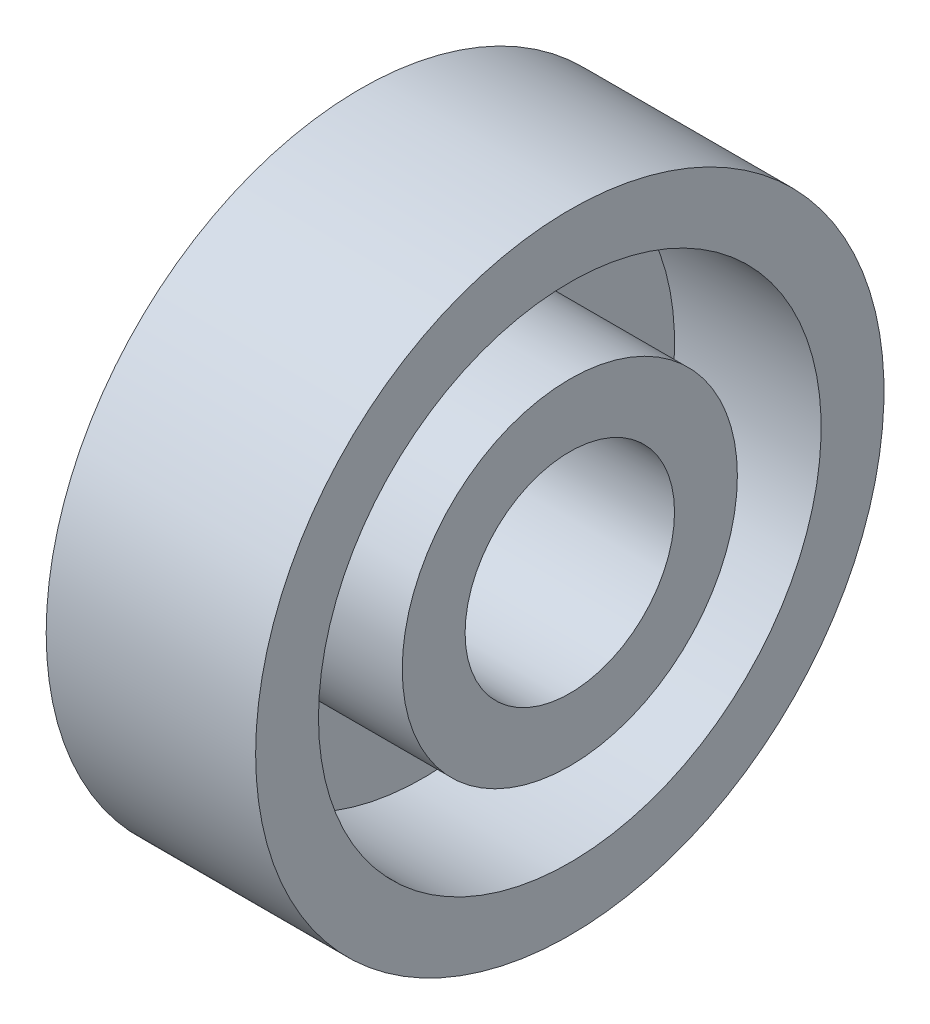
ISO-10303-21;
HEADER;
FILE_DESCRIPTION(('STEP AP214'),'2;1');
FILE_NAME('part.step','',(''),(''),'','','');
FILE_SCHEMA(('AUTOMOTIVE_DESIGN { 1 0 10303 214 1 1 1 1 }'));
ENDSEC;
DATA;
#1=APPLICATION_CONTEXT('core data for automotive mechanical design processes');
#2=APPLICATION_PROTOCOL_DEFINITION('international standard','automotive_design',2000,#1);
#3=PRODUCT_CONTEXT('',#1,'mechanical');
#4=PRODUCT('Part','Part','',(#3));
#5=PRODUCT_RELATED_PRODUCT_CATEGORY('part','',(#4));
#6=PRODUCT_DEFINITION_FORMATION('','',#4);
#7=PRODUCT_DEFINITION_CONTEXT('part definition',#1,'design');
#8=PRODUCT_DEFINITION('design','',#6,#7);
#9=PRODUCT_DEFINITION_SHAPE('','',#8);
#10=(LENGTH_UNIT() NAMED_UNIT(*) SI_UNIT(.MILLI.,.METRE.));
#11=(NAMED_UNIT(*) PLANE_ANGLE_UNIT() SI_UNIT($,.RADIAN.));
#12=(NAMED_UNIT(*) SI_UNIT($,.STERADIAN.) SOLID_ANGLE_UNIT());
#13=UNCERTAINTY_MEASURE_WITH_UNIT(LENGTH_MEASURE(1.E-05),#10,'distance_accuracy_value','');
#14=(GEOMETRIC_REPRESENTATION_CONTEXT(3) GLOBAL_UNCERTAINTY_ASSIGNED_CONTEXT((#13)) GLOBAL_UNIT_ASSIGNED_CONTEXT((#10,
#11,#12)) REPRESENTATION_CONTEXT('',''));
#15=CARTESIAN_POINT('',(0.,0.,0.));
#16=DIRECTION('',(0.,0.,1.));
#17=DIRECTION('',(1.,0.,0.));
#18=AXIS2_PLACEMENT_3D('',#15,#16,#17);
#19=CARTESIAN_POINT('',(4.,3.2,0.));
#20=DIRECTION('',(-1.,0.,0.));
#21=DIRECTION('',(0.,0.,1.));
#22=AXIS2_PLACEMENT_3D('',#19,#20,#21);
#23=PLANE('',#22);
#24=CARTESIAN_POINT('',(4.,0.,0.));
#25=DIRECTION('',(-1.,0.,0.));
#26=DIRECTION('',(0.,0.,1.));
#27=AXIS2_PLACEMENT_3D('',#24,#25,#26);
#28=CIRCLE('',#27,3.2);
#29=CARTESIAN_POINT('',(4.,0.,3.2));
#30=VERTEX_POINT('',#29);
#31=EDGE_CURVE('E56',#30,#30,#28,.T.);
#32=ORIENTED_EDGE('',*,*,#31,.F.);
#33=EDGE_LOOP('',(#32));
#34=FACE_BOUND('',#33,.T.);
#35=CARTESIAN_POINT('',(4.,0.,0.));
#36=DIRECTION('',(-1.,0.,0.));
#37=DIRECTION('',(0.,0.,1.));
#38=AXIS2_PLACEMENT_3D('',#35,#36,#37);
#39=CIRCLE('',#38,2.);
#40=CARTESIAN_POINT('',(4.,0.,2.));
#41=VERTEX_POINT('',#40);
#42=EDGE_CURVE('E10',#41,#41,#39,.T.);
#43=ORIENTED_EDGE('',*,*,#42,.T.);
#44=EDGE_LOOP('',(#43));
#45=FACE_BOUND('',#44,.T.);
#46=ADVANCED_FACE('F28',(#34,#45),#23,.F.);
#47=CARTESIAN_POINT('',(0.,0.,0.));
#48=DIRECTION('',(-1.,0.,0.));
#49=DIRECTION('',(0.,0.,1.));
#50=AXIS2_PLACEMENT_3D('',#47,#48,#49);
#51=CYLINDRICAL_SURFACE('',#50,2.);
#52=ORIENTED_EDGE('',*,*,#42,.F.);
#53=EDGE_LOOP('',(#52));
#54=FACE_BOUND('',#53,.T.);
#55=CARTESIAN_POINT('',(0.,0.,0.));
#56=DIRECTION('',(-1.,0.,0.));
#57=DIRECTION('',(0.,0.,1.));
#58=AXIS2_PLACEMENT_3D('',#55,#56,#57);
#59=CIRCLE('',#58,2.);
#60=CARTESIAN_POINT('',(0.,0.,2.));
#61=VERTEX_POINT('',#60);
#62=EDGE_CURVE('E34',#61,#61,#59,.T.);
#63=ORIENTED_EDGE('',*,*,#62,.T.);
#64=EDGE_LOOP('',(#63));
#65=FACE_BOUND('',#64,.T.);
#66=ADVANCED_FACE('F63',(#54,#65),#51,.F.);
#67=CARTESIAN_POINT('',(0.,2.,0.));
#68=DIRECTION('',(1.,0.,0.));
#69=DIRECTION('',(0.,0.,-1.));
#70=AXIS2_PLACEMENT_3D('',#67,#68,#69);
#71=PLANE('',#70);
#72=ORIENTED_EDGE('',*,*,#62,.F.);
#73=EDGE_LOOP('',(#72));
#74=FACE_BOUND('',#73,.T.);
#75=CARTESIAN_POINT('',(0.,0.,0.));
#76=DIRECTION('',(-1.,0.,0.));
#77=DIRECTION('',(0.,0.,1.));
#78=AXIS2_PLACEMENT_3D('',#75,#76,#77);
#79=CIRCLE('',#78,6.);
#80=CARTESIAN_POINT('',(0.,0.,6.));
#81=VERTEX_POINT('',#80);
#82=EDGE_CURVE('E38',#81,#81,#79,.T.);
#83=ORIENTED_EDGE('',*,*,#82,.T.);
#84=EDGE_LOOP('',(#83));
#85=FACE_BOUND('',#84,.T.);
#86=ADVANCED_FACE('F67',(#74,#85),#71,.F.);
#87=CARTESIAN_POINT('',(0.,0.,0.));
#88=DIRECTION('',(-1.,0.,0.));
#89=DIRECTION('',(0.,0.,1.));
#90=AXIS2_PLACEMENT_3D('',#87,#88,#89);
#91=CYLINDRICAL_SURFACE('',#90,6.);
#92=ORIENTED_EDGE('',*,*,#82,.F.);
#93=EDGE_LOOP('',(#92));
#94=FACE_BOUND('',#93,.T.);
#95=CARTESIAN_POINT('',(4.,0.,0.));
#96=DIRECTION('',(-1.,0.,0.));
#97=DIRECTION('',(0.,0.,1.));
#98=AXIS2_PLACEMENT_3D('',#95,#96,#97);
#99=CIRCLE('',#98,6.);
#100=CARTESIAN_POINT('',(4.,0.,6.));
#101=VERTEX_POINT('',#100);
#102=EDGE_CURVE('E42',#101,#101,#99,.T.);
#103=ORIENTED_EDGE('',*,*,#102,.T.);
#104=EDGE_LOOP('',(#103));
#105=FACE_BOUND('',#104,.T.);
#106=ADVANCED_FACE('F72',(#94,#105),#91,.T.);
#107=CARTESIAN_POINT('',(4.,6.,0.));
#108=DIRECTION('',(-1.,0.,0.));
#109=DIRECTION('',(0.,0.,1.));
#110=AXIS2_PLACEMENT_3D('',#107,#108,#109);
#111=PLANE('',#110);
#112=ORIENTED_EDGE('',*,*,#102,.F.);
#113=EDGE_LOOP('',(#112));
#114=FACE_BOUND('',#113,.T.);
#115=CARTESIAN_POINT('',(4.,0.,0.));
#116=DIRECTION('',(-1.,0.,0.));
#117=DIRECTION('',(0.,0.,1.));
#118=AXIS2_PLACEMENT_3D('',#115,#116,#117);
#119=CIRCLE('',#118,4.8);
#120=CARTESIAN_POINT('',(4.,0.,4.8));
#121=VERTEX_POINT('',#120);
#122=EDGE_CURVE('E47',#121,#121,#119,.T.);
#123=ORIENTED_EDGE('',*,*,#122,.T.);
#124=EDGE_LOOP('',(#123));
#125=FACE_BOUND('',#124,.T.);
#126=ADVANCED_FACE('F78',(#114,#125),#111,.F.);
#127=CARTESIAN_POINT('',(0.,0.,0.));
#128=DIRECTION('',(-1.,0.,0.));
#129=DIRECTION('',(0.,0.,1.));
#130=AXIS2_PLACEMENT_3D('',#127,#128,#129);
#131=CYLINDRICAL_SURFACE('',#130,4.8);
#132=ORIENTED_EDGE('',*,*,#122,.F.);
#133=EDGE_LOOP('',(#132));
#134=FACE_BOUND('',#133,.T.);
#135=CARTESIAN_POINT('',(1.2,0.,0.));
#136=DIRECTION('',(-1.,0.,0.));
#137=DIRECTION('',(0.,0.,1.));
#138=AXIS2_PLACEMENT_3D('',#135,#136,#137);
#139=CIRCLE('',#138,4.8);
#140=CARTESIAN_POINT('',(1.2,0.,4.8));
#141=VERTEX_POINT('',#140);
#142=EDGE_CURVE('E50',#141,#141,#139,.T.);
#143=ORIENTED_EDGE('',*,*,#142,.T.);
#144=EDGE_LOOP('',(#143));
#145=FACE_BOUND('',#144,.T.);
#146=ADVANCED_FACE('F82',(#134,#145),#131,.F.);
#147=CARTESIAN_POINT('',(1.2,4.8,0.));
#148=DIRECTION('',(-1.,0.,0.));
#149=DIRECTION('',(0.,0.,1.));
#150=AXIS2_PLACEMENT_3D('',#147,#148,#149);
#151=PLANE('',#150);
#152=ORIENTED_EDGE('',*,*,#142,.F.);
#153=EDGE_LOOP('',(#152));
#154=FACE_BOUND('',#153,.T.);
#155=CARTESIAN_POINT('',(1.2,0.,0.));
#156=DIRECTION('',(-1.,0.,0.));
#157=DIRECTION('',(0.,0.,1.));
#158=AXIS2_PLACEMENT_3D('',#155,#156,#157);
#159=CIRCLE('',#158,3.2);
#160=CARTESIAN_POINT('',(1.2,0.,3.2));
#161=VERTEX_POINT('',#160);
#162=EDGE_CURVE('E53',#161,#161,#159,.T.);
#163=ORIENTED_EDGE('',*,*,#162,.T.);
#164=EDGE_LOOP('',(#163));
#165=FACE_BOUND('',#164,.T.);
#166=ADVANCED_FACE('F86',(#154,#165),#151,.F.);
#167=CARTESIAN_POINT('',(0.,0.,0.));
#168=DIRECTION('',(-1.,0.,0.));
#169=DIRECTION('',(0.,0.,1.));
#170=AXIS2_PLACEMENT_3D('',#167,#168,#169);
#171=CYLINDRICAL_SURFACE('',#170,3.2);
#172=ORIENTED_EDGE('',*,*,#162,.F.);
#173=EDGE_LOOP('',(#172));
#174=FACE_BOUND('',#173,.T.);
#175=ORIENTED_EDGE('',*,*,#31,.T.);
#176=EDGE_LOOP('',(#175));
#177=FACE_BOUND('',#176,.T.);
#178=ADVANCED_FACE('F60',(#174,#177),#171,.T.);
#179=CLOSED_SHELL('',(#46,#66,#86,#106,#126,#146,#166,#178));
#180=MANIFOLD_SOLID_BREP('B2',#179);
#181=ADVANCED_BREP_SHAPE_REPRESENTATION('',(#18,#180),#14);
#182=SHAPE_DEFINITION_REPRESENTATION(#9,#181);
ENDSEC;
END-ISO-10303-21;
